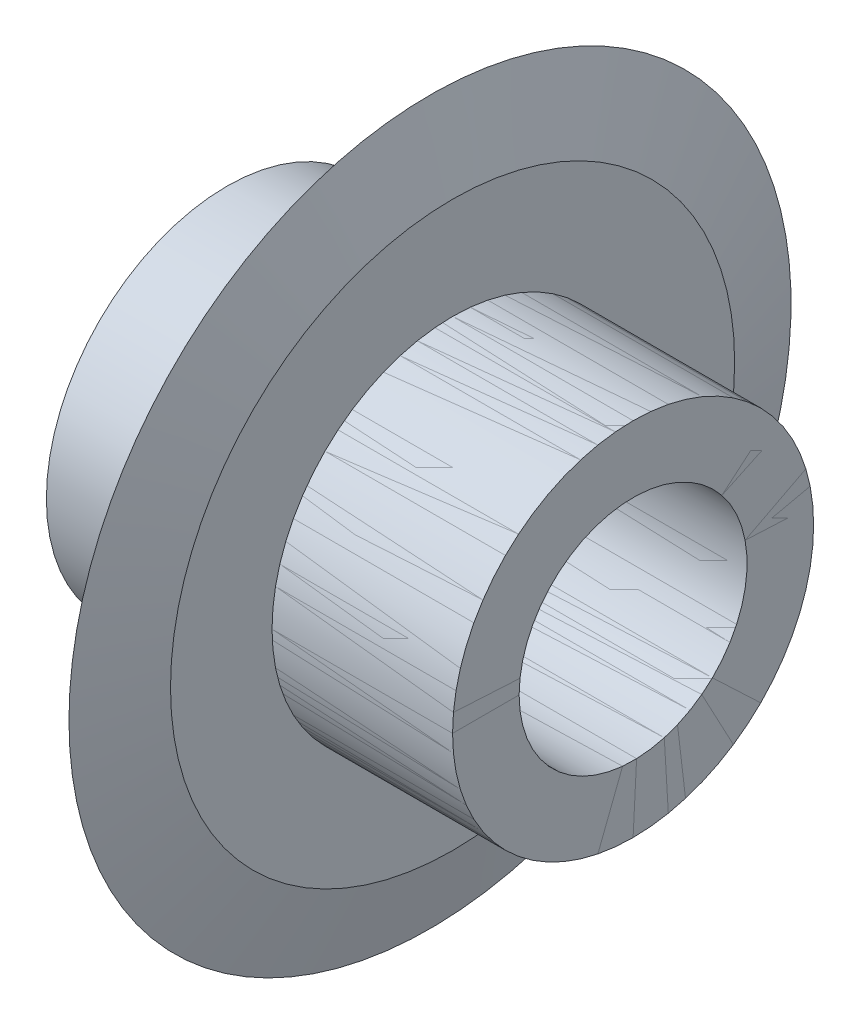
ISO-10303-21;
HEADER;
FILE_DESCRIPTION(('STEP AP214'),'2;1');
FILE_NAME('part.step','',(''),(''),'','','');
FILE_SCHEMA(('AUTOMOTIVE_DESIGN { 1 0 10303 214 1 1 1 1 }'));
ENDSEC;
DATA;
#1=APPLICATION_CONTEXT('core data for automotive mechanical design processes');
#2=APPLICATION_PROTOCOL_DEFINITION('international standard','automotive_design',2000,#1);
#3=PRODUCT_CONTEXT('',#1,'mechanical');
#4=PRODUCT('Part','Part','',(#3));
#5=PRODUCT_RELATED_PRODUCT_CATEGORY('part','',(#4));
#6=PRODUCT_DEFINITION_FORMATION('','',#4);
#7=PRODUCT_DEFINITION_CONTEXT('part definition',#1,'design');
#8=PRODUCT_DEFINITION('design','',#6,#7);
#9=PRODUCT_DEFINITION_SHAPE('','',#8);
#10=(LENGTH_UNIT() NAMED_UNIT(*) SI_UNIT(.MILLI.,.METRE.));
#11=(NAMED_UNIT(*) PLANE_ANGLE_UNIT() SI_UNIT($,.RADIAN.));
#12=(NAMED_UNIT(*) SI_UNIT($,.STERADIAN.) SOLID_ANGLE_UNIT());
#13=UNCERTAINTY_MEASURE_WITH_UNIT(LENGTH_MEASURE(1.E-05),#10,'distance_accuracy_value','');
#14=(GEOMETRIC_REPRESENTATION_CONTEXT(3) GLOBAL_UNCERTAINTY_ASSIGNED_CONTEXT((#13)) GLOBAL_UNIT_ASSIGNED_CONTEXT((#10,
#11,#12)) REPRESENTATION_CONTEXT('',''));
#15=CARTESIAN_POINT('',(0.,0.,0.));
#16=DIRECTION('',(0.,0.,1.));
#17=DIRECTION('',(1.,0.,0.));
#18=AXIS2_PLACEMENT_3D('',#15,#16,#17);
#19=CARTESIAN_POINT('',(-10.777777777778,0.,0.));
#20=DIRECTION('',(-1.,0.,0.));
#21=DIRECTION('',(0.,0.,1.));
#22=AXIS2_PLACEMENT_3D('',#19,#20,#21);
#23=CYLINDRICAL_SURFACE('',#22,5.05);
#24=CARTESIAN_POINT('',(9.,0.,0.));
#25=DIRECTION('',(-1.,0.,0.));
#26=DIRECTION('',(0.,0.,1.));
#27=AXIS2_PLACEMENT_3D('',#24,#25,#26);
#28=CIRCLE('',#27,5.05);
#29=CARTESIAN_POINT('',(9.,0.,5.05));
#30=VERTEX_POINT('',#29);
#31=EDGE_CURVE('E55',#30,#30,#28,.T.);
#32=ORIENTED_EDGE('',*,*,#31,.F.);
#33=EDGE_LOOP('',(#32));
#34=FACE_BOUND('',#33,.T.);
#35=CARTESIAN_POINT('',(-8.99999999999999,0.,0.));
#36=DIRECTION('',(-1.,0.,0.));
#37=DIRECTION('',(0.,0.,1.));
#38=AXIS2_PLACEMENT_3D('',#35,#36,#37);
#39=CIRCLE('',#38,5.05);
#40=CARTESIAN_POINT('',(-8.99999999999999,0.,5.05));
#41=VERTEX_POINT('',#40);
#42=EDGE_CURVE('E11',#41,#41,#39,.T.);
#43=ORIENTED_EDGE('',*,*,#42,.T.);
#44=EDGE_LOOP('',(#43));
#45=FACE_BOUND('',#44,.T.);
#46=ADVANCED_FACE('F41',(#34,#45),#23,.F.);
#47=CARTESIAN_POINT('',(-8.99999999999999,0.,0.));
#48=DIRECTION('',(-1.,0.,0.));
#49=DIRECTION('',(0.,0.,1.));
#50=AXIS2_PLACEMENT_3D('',#47,#48,#49);
#51=PLANE('',#50);
#52=CARTESIAN_POINT('',(-8.99999999999999,0.,0.));
#53=DIRECTION('',(-1.,0.,0.));
#54=DIRECTION('',(0.,0.,1.));
#55=AXIS2_PLACEMENT_3D('',#52,#53,#54);
#56=CIRCLE('',#55,8.);
#57=CARTESIAN_POINT('',(-8.99999999999999,0.,8.));
#58=VERTEX_POINT('',#57);
#59=EDGE_CURVE('E47',#58,#58,#56,.T.);
#60=ORIENTED_EDGE('',*,*,#59,.T.);
#61=EDGE_LOOP('',(#60));
#62=FACE_BOUND('',#61,.T.);
#63=ORIENTED_EDGE('',*,*,#42,.F.);
#64=EDGE_LOOP('',(#63));
#65=FACE_BOUND('',#64,.T.);
#66=ADVANCED_FACE('F64',(#62,#65),#51,.T.);
#67=CARTESIAN_POINT('',(-10.777777777778,0.,0.));
#68=DIRECTION('',(-1.,0.,0.));
#69=DIRECTION('',(0.,0.,1.));
#70=AXIS2_PLACEMENT_3D('',#67,#68,#69);
#71=CYLINDRICAL_SURFACE('',#70,8.);
#72=CARTESIAN_POINT('',(9.,0.,0.));
#73=DIRECTION('',(-1.,0.,0.));
#74=DIRECTION('',(0.,0.,1.));
#75=AXIS2_PLACEMENT_3D('',#72,#73,#74);
#76=CIRCLE('',#75,8.);
#77=CARTESIAN_POINT('',(9.,0.,8.));
#78=VERTEX_POINT('',#77);
#79=EDGE_CURVE('E51',#78,#78,#76,.T.);
#80=ORIENTED_EDGE('',*,*,#79,.T.);
#81=EDGE_LOOP('',(#80));
#82=FACE_BOUND('',#81,.T.);
#83=ORIENTED_EDGE('',*,*,#59,.F.);
#84=EDGE_LOOP('',(#83));
#85=FACE_BOUND('',#84,.T.);
#86=ADVANCED_FACE('F68',(#82,#85),#71,.T.);
#87=CARTESIAN_POINT('',(9.,0.,0.));
#88=DIRECTION('',(-1.,0.,0.));
#89=DIRECTION('',(0.,0.,1.));
#90=AXIS2_PLACEMENT_3D('',#87,#88,#89);
#91=PLANE('',#90);
#92=ORIENTED_EDGE('',*,*,#79,.F.);
#93=EDGE_LOOP('',(#92));
#94=FACE_BOUND('',#93,.T.);
#95=ORIENTED_EDGE('',*,*,#31,.T.);
#96=EDGE_LOOP('',(#95));
#97=FACE_BOUND('',#96,.T.);
#98=ADVANCED_FACE('F61',(#94,#97),#91,.F.);
#99=CLOSED_SHELL('',(#46,#66,#86,#98));
#100=MANIFOLD_SOLID_BREP('B2',#99);
#101=CARTESIAN_POINT('',(-10.777777777778,0.,0.));
#102=DIRECTION('',(-1.,0.,0.));
#103=DIRECTION('',(0.,0.,1.));
#104=AXIS2_PLACEMENT_3D('',#101,#102,#103);
#105=CYLINDRICAL_SURFACE('',#104,8.);
#106=CARTESIAN_POINT('',(-0.999999999999999,0.,0.));
#107=DIRECTION('',(-1.,0.,0.));
#108=DIRECTION('',(0.,0.,1.));
#109=AXIS2_PLACEMENT_3D('',#106,#107,#108);
#110=CIRCLE('',#109,8.);
#111=CARTESIAN_POINT('',(-0.999999999999999,0.,8.));
#112=VERTEX_POINT('',#111);
#113=EDGE_CURVE('E135',#112,#112,#110,.T.);
#114=ORIENTED_EDGE('',*,*,#113,.T.);
#115=EDGE_LOOP('',(#114));
#116=FACE_BOUND('',#115,.T.);
#117=CARTESIAN_POINT('',(-8.99999999999999,0.,0.));
#118=DIRECTION('',(-1.,0.,0.));
#119=DIRECTION('',(0.,0.,1.));
#120=AXIS2_PLACEMENT_3D('',#117,#118,#119);
#121=CIRCLE('',#120,8.);
#122=CARTESIAN_POINT('',(-8.99999999999999,0.,8.));
#123=VERTEX_POINT('',#122);
#124=EDGE_CURVE('E40',#123,#123,#121,.T.);
#125=ORIENTED_EDGE('',*,*,#124,.F.);
#126=EDGE_LOOP('',(#125));
#127=FACE_BOUND('',#126,.T.);
#128=ADVANCED_FACE('F103',(#116,#127),#105,.T.);
#129=CARTESIAN_POINT('',(-8.99999999999999,0.,0.));
#130=DIRECTION('',(1.,0.,0.));
#131=DIRECTION('',(0.,0.,-1.));
#132=AXIS2_PLACEMENT_3D('',#129,#130,#131);
#133=PLANE('',#132);
#134=CARTESIAN_POINT('',(-8.99999999999999,0.,0.));
#135=DIRECTION('',(-1.,0.,0.));
#136=DIRECTION('',(0.,0.,1.));
#137=AXIS2_PLACEMENT_3D('',#134,#135,#136);
#138=CIRCLE('',#137,5.05);
#139=CARTESIAN_POINT('',(-8.99999999999999,0.,5.05));
#140=VERTEX_POINT('',#139);
#141=EDGE_CURVE('E110',#140,#140,#138,.T.);
#142=ORIENTED_EDGE('',*,*,#141,.F.);
#143=EDGE_LOOP('',(#142));
#144=FACE_BOUND('',#143,.T.);
#145=ORIENTED_EDGE('',*,*,#124,.T.);
#146=EDGE_LOOP('',(#145));
#147=FACE_BOUND('',#146,.T.);
#148=ADVANCED_FACE('F105',(#144,#147),#133,.F.);
#149=CARTESIAN_POINT('',(-10.777777777778,0.,0.));
#150=DIRECTION('',(-1.,0.,0.));
#151=DIRECTION('',(0.,0.,1.));
#152=AXIS2_PLACEMENT_3D('',#149,#150,#151);
#153=CYLINDRICAL_SURFACE('',#152,5.05);
#154=CARTESIAN_POINT('',(9.00000000000001,0.,0.));
#155=DIRECTION('',(-1.,0.,0.));
#156=DIRECTION('',(0.,0.,1.));
#157=AXIS2_PLACEMENT_3D('',#154,#155,#156);
#158=CIRCLE('',#157,5.05);
#159=CARTESIAN_POINT('',(9.00000000000001,0.,5.05));
#160=VERTEX_POINT('',#159);
#161=EDGE_CURVE('E114',#160,#160,#158,.T.);
#162=ORIENTED_EDGE('',*,*,#161,.F.);
#163=EDGE_LOOP('',(#162));
#164=FACE_BOUND('',#163,.T.);
#165=ORIENTED_EDGE('',*,*,#141,.T.);
#166=EDGE_LOOP('',(#165));
#167=FACE_BOUND('',#166,.T.);
#168=ADVANCED_FACE('F158',(#164,#167),#153,.F.);
#169=CARTESIAN_POINT('',(9.00000000000001,0.,0.));
#170=DIRECTION('',(1.,0.,0.));
#171=DIRECTION('',(0.,0.,-1.));
#172=AXIS2_PLACEMENT_3D('',#169,#170,#171);
#173=PLANE('',#172);
#174=ORIENTED_EDGE('',*,*,#161,.T.);
#175=EDGE_LOOP('',(#174));
#176=FACE_BOUND('',#175,.T.);
#177=CARTESIAN_POINT('',(9.00000000000001,0.,0.));
#178=DIRECTION('',(-1.,0.,0.));
#179=DIRECTION('',(0.,0.,1.));
#180=AXIS2_PLACEMENT_3D('',#177,#178,#179);
#181=CIRCLE('',#180,8.);
#182=CARTESIAN_POINT('',(9.00000000000001,0.,8.));
#183=VERTEX_POINT('',#182);
#184=EDGE_CURVE('E118',#183,#183,#181,.T.);
#185=ORIENTED_EDGE('',*,*,#184,.F.);
#186=EDGE_LOOP('',(#185));
#187=FACE_BOUND('',#186,.T.);
#188=ADVANCED_FACE('F164',(#176,#187),#173,.T.);
#189=ORIENTED_EDGE('',*,*,#184,.T.);
#190=EDGE_LOOP('',(#189));
#191=FACE_BOUND('',#190,.T.);
#192=CARTESIAN_POINT('',(0.999999999999999,0.,0.));
#193=DIRECTION('',(-1.,0.,0.));
#194=DIRECTION('',(0.,0.,1.));
#195=AXIS2_PLACEMENT_3D('',#192,#193,#194);
#196=CIRCLE('',#195,8.);
#197=CARTESIAN_POINT('',(0.999999999999999,0.,8.));
#198=VERTEX_POINT('',#197);
#199=EDGE_CURVE('E123',#198,#198,#196,.T.);
#200=ORIENTED_EDGE('',*,*,#199,.F.);
#201=EDGE_LOOP('',(#200));
#202=FACE_BOUND('',#201,.T.);
#203=ADVANCED_FACE('F154',(#191,#202),#105,.T.);
#204=CARTESIAN_POINT('',(1.,0.,0.));
#205=DIRECTION('',(1.,0.,0.));
#206=DIRECTION('',(0.,0.,-1.));
#207=AXIS2_PLACEMENT_3D('',#204,#205,#206);
#208=PLANE('',#207);
#209=ORIENTED_EDGE('',*,*,#199,.T.);
#210=EDGE_LOOP('',(#209));
#211=FACE_BOUND('',#210,.T.);
#212=CARTESIAN_POINT('',(1.,0.,0.));
#213=DIRECTION('',(-1.,0.,0.));
#214=DIRECTION('',(0.,0.,1.));
#215=AXIS2_PLACEMENT_3D('',#212,#213,#214);
#216=CIRCLE('',#215,12.5);
#217=CARTESIAN_POINT('',(1.,0.,12.5));
#218=VERTEX_POINT('',#217);
#219=EDGE_CURVE('E126',#218,#218,#216,.T.);
#220=ORIENTED_EDGE('',*,*,#219,.F.);
#221=EDGE_LOOP('',(#220));
#222=FACE_BOUND('',#221,.T.);
#223=ADVANCED_FACE('F163',(#211,#222),#208,.T.);
#224=CARTESIAN_POINT('',(0.,0.,0.));
#225=DIRECTION('',(-1.,0.,0.));
#226=DIRECTION('',(0.,0.,1.));
#227=AXIS2_PLACEMENT_3D('',#224,#225,#226);
#228=CONICAL_SURFACE('',#227,16.,1.29249666778978);
#229=ORIENTED_EDGE('',*,*,#219,.T.);
#230=EDGE_LOOP('',(#229));
#231=FACE_BOUND('',#230,.T.);
#232=CARTESIAN_POINT('',(0.,0.,0.));
#233=DIRECTION('',(-1.,0.,0.));
#234=DIRECTION('',(0.,0.,1.));
#235=AXIS2_PLACEMENT_3D('',#232,#233,#234);
#236=CIRCLE('',#235,16.);
#237=CARTESIAN_POINT('',(0.,0.,16.));
#238=VERTEX_POINT('',#237);
#239=EDGE_CURVE('E129',#238,#238,#236,.T.);
#240=ORIENTED_EDGE('',*,*,#239,.F.);
#241=EDGE_LOOP('',(#240));
#242=FACE_BOUND('',#241,.T.);
#243=ADVANCED_FACE('F149',(#231,#242),#228,.T.);
#244=CARTESIAN_POINT('',(-0.999999999999999,0.,0.));
#245=DIRECTION('',(1.,0.,0.));
#246=DIRECTION('',(0.,0.,-1.));
#247=AXIS2_PLACEMENT_3D('',#244,#245,#246);
#248=CONICAL_SURFACE('',#247,12.5,1.29249666778979);
#249=ORIENTED_EDGE('',*,*,#239,.T.);
#250=EDGE_LOOP('',(#249));
#251=FACE_BOUND('',#250,.T.);
#252=CARTESIAN_POINT('',(-0.999999999999999,0.,0.));
#253=DIRECTION('',(-1.,0.,0.));
#254=DIRECTION('',(0.,0.,1.));
#255=AXIS2_PLACEMENT_3D('',#252,#253,#254);
#256=CIRCLE('',#255,12.5);
#257=CARTESIAN_POINT('',(-0.999999999999999,0.,12.5));
#258=VERTEX_POINT('',#257);
#259=EDGE_CURVE('E132',#258,#258,#256,.T.);
#260=ORIENTED_EDGE('',*,*,#259,.F.);
#261=EDGE_LOOP('',(#260));
#262=FACE_BOUND('',#261,.T.);
#263=ADVANCED_FACE('F143',(#251,#262),#248,.T.);
#264=CARTESIAN_POINT('',(-1.,0.,0.));
#265=DIRECTION('',(-1.,0.,0.));
#266=DIRECTION('',(0.,0.,1.));
#267=AXIS2_PLACEMENT_3D('',#264,#265,#266);
#268=PLANE('',#267);
#269=ORIENTED_EDGE('',*,*,#259,.T.);
#270=EDGE_LOOP('',(#269));
#271=FACE_BOUND('',#270,.T.);
#272=ORIENTED_EDGE('',*,*,#113,.F.);
#273=EDGE_LOOP('',(#272));
#274=FACE_BOUND('',#273,.T.);
#275=ADVANCED_FACE('F141',(#271,#274),#268,.T.);
#276=CLOSED_SHELL('',(#128,#148,#168,#188,#203,#223,#243,#263,#275));
#277=MANIFOLD_SOLID_BREP('B6',#276);
#278=ADVANCED_BREP_SHAPE_REPRESENTATION('',(#18,#100,#277),#14);
#279=SHAPE_DEFINITION_REPRESENTATION(#9,#278);
ENDSEC;
END-ISO-10303-21;
